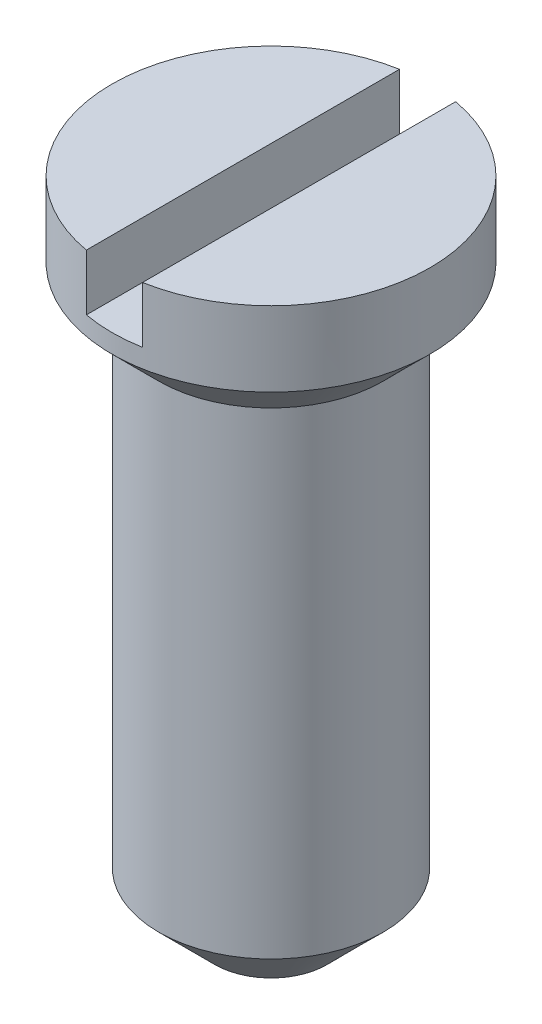
ISO-10303-21;
HEADER;
FILE_DESCRIPTION(('STEP AP214'),'2;1');
FILE_NAME('part.step','',(''),(''),'','','');
FILE_SCHEMA(('AUTOMOTIVE_DESIGN { 1 0 10303 214 1 1 1 1 }'));
ENDSEC;
DATA;
#1=APPLICATION_CONTEXT('core data for automotive mechanical design processes');
#2=APPLICATION_PROTOCOL_DEFINITION('international standard','automotive_design',2000,#1);
#3=PRODUCT_CONTEXT('',#1,'mechanical');
#4=PRODUCT('Part','Part','',(#3));
#5=PRODUCT_RELATED_PRODUCT_CATEGORY('part','',(#4));
#6=PRODUCT_DEFINITION_FORMATION('','',#4);
#7=PRODUCT_DEFINITION_CONTEXT('part definition',#1,'design');
#8=PRODUCT_DEFINITION('design','',#6,#7);
#9=PRODUCT_DEFINITION_SHAPE('','',#8);
#10=(LENGTH_UNIT() NAMED_UNIT(*) SI_UNIT(.MILLI.,.METRE.));
#11=(NAMED_UNIT(*) PLANE_ANGLE_UNIT() SI_UNIT($,.RADIAN.));
#12=(NAMED_UNIT(*) SI_UNIT($,.STERADIAN.) SOLID_ANGLE_UNIT());
#13=UNCERTAINTY_MEASURE_WITH_UNIT(LENGTH_MEASURE(1.E-05),#10,'distance_accuracy_value','');
#14=(GEOMETRIC_REPRESENTATION_CONTEXT(3) GLOBAL_UNCERTAINTY_ASSIGNED_CONTEXT((#13)) GLOBAL_UNIT_ASSIGNED_CONTEXT((#10,
#11,#12)) REPRESENTATION_CONTEXT('',''));
#15=CARTESIAN_POINT('',(0.,0.,0.));
#16=DIRECTION('',(0.,0.,1.));
#17=DIRECTION('',(1.,0.,0.));
#18=AXIS2_PLACEMENT_3D('',#15,#16,#17);
#19=CARTESIAN_POINT('',(0.,3.5,0.));
#20=DIRECTION('',(0.,1.,0.));
#21=DIRECTION('',(0.,0.,1.));
#22=AXIS2_PLACEMENT_3D('',#19,#20,#21);
#23=PLANE('',#22);
#24=DIRECTION('',(0.,0.,-1.));
#25=VECTOR('',#24,1.);
#26=CARTESIAN_POINT('',(0.15,3.5,0.));
#27=LINE('',#26,#25);
#28=CARTESIAN_POINT('',(0.15,3.5,0.836660026534075));
#29=VERTEX_POINT('',#28);
#30=CARTESIAN_POINT('',(0.15,3.5,-0.836660026534075));
#31=VERTEX_POINT('',#30);
#32=EDGE_CURVE('E99',#29,#31,#27,.T.);
#33=ORIENTED_EDGE('',*,*,#32,.F.);
#34=CARTESIAN_POINT('',(0.,3.5,0.));
#35=DIRECTION('',(0.,1.,0.));
#36=DIRECTION('',(0.,0.,1.));
#37=AXIS2_PLACEMENT_3D('',#34,#35,#36);
#38=CIRCLE('',#37,0.85);
#39=EDGE_CURVE('E100',#29,#31,#38,.T.);
#40=ORIENTED_EDGE('',*,*,#39,.T.);
#41=EDGE_LOOP('',(#33,#40));
#42=FACE_BOUND('',#41,.T.);
#43=ADVANCED_FACE('F51',(#42),#23,.T.);
#44=CARTESIAN_POINT('',(0.,3.5,0.));
#45=DIRECTION('',(0.,-1.,0.));
#46=DIRECTION('',(0.,0.,-1.));
#47=AXIS2_PLACEMENT_3D('',#44,#45,#46);
#48=CYLINDRICAL_SURFACE('',#47,0.85);
#49=ORIENTED_EDGE('',*,*,#39,.F.);
#50=DIRECTION('',(0.,-1.,0.));
#51=VECTOR('',#50,1.);
#52=CARTESIAN_POINT('',(0.15,3.5,0.836660026534075));
#53=LINE('',#52,#51);
#54=CARTESIAN_POINT('',(0.15,3.2,0.836660026534075));
#55=VERTEX_POINT('',#54);
#56=EDGE_CURVE('E171',#29,#55,#53,.T.);
#57=ORIENTED_EDGE('',*,*,#56,.T.);
#58=CARTESIAN_POINT('',(0.,3.2,0.));
#59=DIRECTION('',(0.,-1.,0.));
#60=DIRECTION('',(0.,0.,-1.));
#61=AXIS2_PLACEMENT_3D('',#58,#59,#60);
#62=CIRCLE('',#61,0.85);
#63=CARTESIAN_POINT('',(-0.15,3.2,0.836660026534075));
#64=VERTEX_POINT('',#63);
#65=EDGE_CURVE('E109',#55,#64,#62,.T.);
#66=ORIENTED_EDGE('',*,*,#65,.T.);
#67=DIRECTION('',(0.,-1.,0.));
#68=VECTOR('',#67,1.);
#69=CARTESIAN_POINT('',(-0.15,3.5,0.836660026534075));
#70=LINE('',#69,#68);
#71=CARTESIAN_POINT('',(-0.15,3.5,0.836660026534075));
#72=VERTEX_POINT('',#71);
#73=EDGE_CURVE('E94',#64,#72,#70,.F.);
#74=ORIENTED_EDGE('',*,*,#73,.T.);
#75=CARTESIAN_POINT('',(-0.15,3.5,-0.836660026534075));
#76=VERTEX_POINT('',#75);
#77=EDGE_CURVE('E107',#76,#72,#38,.T.);
#78=ORIENTED_EDGE('',*,*,#77,.F.);
#79=DIRECTION('',(0.,-1.,0.));
#80=VECTOR('',#79,1.);
#81=CARTESIAN_POINT('',(-0.15,3.5,-0.836660026534075));
#82=LINE('',#81,#80);
#83=CARTESIAN_POINT('',(-0.15,3.2,-0.836660026534075));
#84=VERTEX_POINT('',#83);
#85=EDGE_CURVE('E66',#76,#84,#82,.T.);
#86=ORIENTED_EDGE('',*,*,#85,.T.);
#87=CARTESIAN_POINT('',(0.15,3.2,-0.836660026534075));
#88=VERTEX_POINT('',#87);
#89=EDGE_CURVE('E122',#84,#88,#62,.T.);
#90=ORIENTED_EDGE('',*,*,#89,.T.);
#91=DIRECTION('',(0.,-1.,0.));
#92=VECTOR('',#91,1.);
#93=CARTESIAN_POINT('',(0.15,3.5,-0.836660026534075));
#94=LINE('',#93,#92);
#95=EDGE_CURVE('E74',#88,#31,#94,.F.);
#96=ORIENTED_EDGE('',*,*,#95,.T.);
#97=EDGE_LOOP('',(#49,#57,#66,#74,#78,#86,#90,#96));
#98=FACE_BOUND('',#97,.T.);
#99=CARTESIAN_POINT('',(0.,3.1,0.));
#100=DIRECTION('',(0.,-1.,0.));
#101=DIRECTION('',(0.,0.,-1.));
#102=AXIS2_PLACEMENT_3D('',#99,#100,#101);
#103=CIRCLE('',#102,0.85);
#104=CARTESIAN_POINT('',(0.,3.1,-0.85));
#105=VERTEX_POINT('',#104);
#106=EDGE_CURVE('E113',#105,#105,#103,.T.);
#107=ORIENTED_EDGE('',*,*,#106,.F.);
#108=EDGE_LOOP('',(#107));
#109=FACE_BOUND('',#108,.T.);
#110=ADVANCED_FACE('F105',(#98,#109),#48,.T.);
#111=DIRECTION('',(0.,0.,1.));
#112=VECTOR('',#111,1.);
#113=CARTESIAN_POINT('',(-0.15,3.5,0.));
#114=LINE('',#113,#112);
#115=EDGE_CURVE('E91',#76,#72,#114,.T.);
#116=ORIENTED_EDGE('',*,*,#115,.F.);
#117=ORIENTED_EDGE('',*,*,#77,.T.);
#118=EDGE_LOOP('',(#116,#117));
#119=FACE_BOUND('',#118,.T.);
#120=ADVANCED_FACE('F112',(#119),#23,.T.);
#121=CARTESIAN_POINT('',(0.,0.,0.));
#122=DIRECTION('',(0.,-1.,0.));
#123=DIRECTION('',(0.,0.,-1.));
#124=AXIS2_PLACEMENT_3D('',#121,#122,#123);
#125=CYLINDRICAL_SURFACE('',#124,0.6);
#126=CARTESIAN_POINT('',(0.,0.300000000000001,0.));
#127=DIRECTION('',(0.,1.,0.));
#128=DIRECTION('',(0.,0.,1.));
#129=AXIS2_PLACEMENT_3D('',#126,#127,#128);
#130=CIRCLE('',#129,0.6);
#131=CARTESIAN_POINT('',(0.,0.300000000000001,0.6));
#132=VERTEX_POINT('',#131);
#133=EDGE_CURVE('E13',#132,#132,#130,.T.);
#134=ORIENTED_EDGE('',*,*,#133,.T.);
#135=EDGE_LOOP('',(#134));
#136=FACE_BOUND('',#135,.T.);
#137=CARTESIAN_POINT('',(0.,2.85,0.));
#138=DIRECTION('',(0.,-1.,0.));
#139=DIRECTION('',(0.,0.,-1.));
#140=AXIS2_PLACEMENT_3D('',#137,#138,#139);
#141=CIRCLE('',#140,0.6);
#142=CARTESIAN_POINT('',(0.,2.85,-0.6));
#143=VERTEX_POINT('',#142);
#144=EDGE_CURVE('E117',#143,#143,#141,.T.);
#145=ORIENTED_EDGE('',*,*,#144,.T.);
#146=EDGE_LOOP('',(#145));
#147=FACE_BOUND('',#146,.T.);
#148=ADVANCED_FACE('F147',(#136,#147),#125,.T.);
#149=CARTESIAN_POINT('',(0.,3.1,0.));
#150=DIRECTION('',(0.,1.,0.));
#151=DIRECTION('',(0.,0.,1.));
#152=AXIS2_PLACEMENT_3D('',#149,#150,#151);
#153=CONICAL_SURFACE('',#152,0.85,0.785398163397448);
#154=ORIENTED_EDGE('',*,*,#144,.F.);
#155=EDGE_LOOP('',(#154));
#156=FACE_BOUND('',#155,.T.);
#157=ORIENTED_EDGE('',*,*,#106,.T.);
#158=EDGE_LOOP('',(#157));
#159=FACE_BOUND('',#158,.T.);
#160=ADVANCED_FACE('F151',(#156,#159),#153,.T.);
#161=CARTESIAN_POINT('',(0.,0.,0.));
#162=DIRECTION('',(0.,1.,0.));
#163=DIRECTION('',(0.,0.,1.));
#164=AXIS2_PLACEMENT_3D('',#161,#162,#163);
#165=PLANE('',#164);
#166=CARTESIAN_POINT('',(0.,0.,0.));
#167=DIRECTION('',(0.,1.,0.));
#168=DIRECTION('',(0.,0.,1.));
#169=AXIS2_PLACEMENT_3D('',#166,#167,#168);
#170=CIRCLE('',#169,0.3);
#171=CARTESIAN_POINT('',(0.,0.,0.3));
#172=VERTEX_POINT('',#171);
#173=EDGE_CURVE('E59',#172,#172,#170,.F.);
#174=ORIENTED_EDGE('',*,*,#173,.T.);
#175=EDGE_LOOP('',(#174));
#176=FACE_BOUND('',#175,.T.);
#177=ADVANCED_FACE('F127',(#176),#165,.F.);
#178=CARTESIAN_POINT('',(0.,3.2,0.));
#179=DIRECTION('',(0.,-1.,0.));
#180=DIRECTION('',(0.,0.,-1.));
#181=AXIS2_PLACEMENT_3D('',#178,#179,#180);
#182=PLANE('',#181);
#183=DIRECTION('',(0.,0.,-1.));
#184=VECTOR('',#183,1.);
#185=CARTESIAN_POINT('',(0.15,3.2,0.95));
#186=LINE('',#185,#184);
#187=EDGE_CURVE('E168',#55,#88,#186,.T.);
#188=ORIENTED_EDGE('',*,*,#187,.T.);
#189=ORIENTED_EDGE('',*,*,#89,.F.);
#190=DIRECTION('',(0.,0.,1.));
#191=VECTOR('',#190,1.);
#192=CARTESIAN_POINT('',(-0.15,3.2,0.95));
#193=LINE('',#192,#191);
#194=EDGE_CURVE('E110',#84,#64,#193,.T.);
#195=ORIENTED_EDGE('',*,*,#194,.T.);
#196=ORIENTED_EDGE('',*,*,#65,.F.);
#197=EDGE_LOOP('',(#188,#189,#195,#196));
#198=FACE_BOUND('',#197,.T.);
#199=ADVANCED_FACE('F161',(#198),#182,.F.);
#200=CARTESIAN_POINT('',(0.15,3.2,0.95));
#201=DIRECTION('',(1.,0.,0.));
#202=DIRECTION('',(0.,0.,-1.));
#203=AXIS2_PLACEMENT_3D('',#200,#201,#202);
#204=PLANE('',#203);
#205=ORIENTED_EDGE('',*,*,#32,.T.);
#206=ORIENTED_EDGE('',*,*,#95,.F.);
#207=ORIENTED_EDGE('',*,*,#187,.F.);
#208=ORIENTED_EDGE('',*,*,#56,.F.);
#209=EDGE_LOOP('',(#205,#206,#207,#208));
#210=FACE_BOUND('',#209,.T.);
#211=ADVANCED_FACE('F134',(#210),#204,.F.);
#212=CARTESIAN_POINT('',(-0.15,3.2,0.95));
#213=DIRECTION('',(-1.,0.,0.));
#214=DIRECTION('',(0.,0.,1.));
#215=AXIS2_PLACEMENT_3D('',#212,#213,#214);
#216=PLANE('',#215);
#217=ORIENTED_EDGE('',*,*,#115,.T.);
#218=ORIENTED_EDGE('',*,*,#73,.F.);
#219=ORIENTED_EDGE('',*,*,#194,.F.);
#220=ORIENTED_EDGE('',*,*,#85,.F.);
#221=EDGE_LOOP('',(#217,#218,#219,#220));
#222=FACE_BOUND('',#221,.T.);
#223=ADVANCED_FACE('F93',(#222),#216,.F.);
#224=CARTESIAN_POINT('',(0.,0.,0.));
#225=DIRECTION('',(0.,1.,0.));
#226=DIRECTION('',(0.,0.,1.));
#227=AXIS2_PLACEMENT_3D('',#224,#225,#226);
#228=CONICAL_SURFACE('',#227,0.3,0.785398163397447);
#229=ORIENTED_EDGE('',*,*,#133,.F.);
#230=EDGE_LOOP('',(#229));
#231=FACE_BOUND('',#230,.T.);
#232=ORIENTED_EDGE('',*,*,#173,.F.);
#233=EDGE_LOOP('',(#232));
#234=FACE_BOUND('',#233,.T.);
#235=ADVANCED_FACE('F53',(#231,#234),#228,.T.);
#236=CLOSED_SHELL('',(#43,#110,#120,#148,#160,#177,#199,#211,#223,#235));
#237=MANIFOLD_SOLID_BREP('B2',#236);
#238=ADVANCED_BREP_SHAPE_REPRESENTATION('',(#18,#237),#14);
#239=SHAPE_DEFINITION_REPRESENTATION(#9,#238);
ENDSEC;
END-ISO-10303-21;
